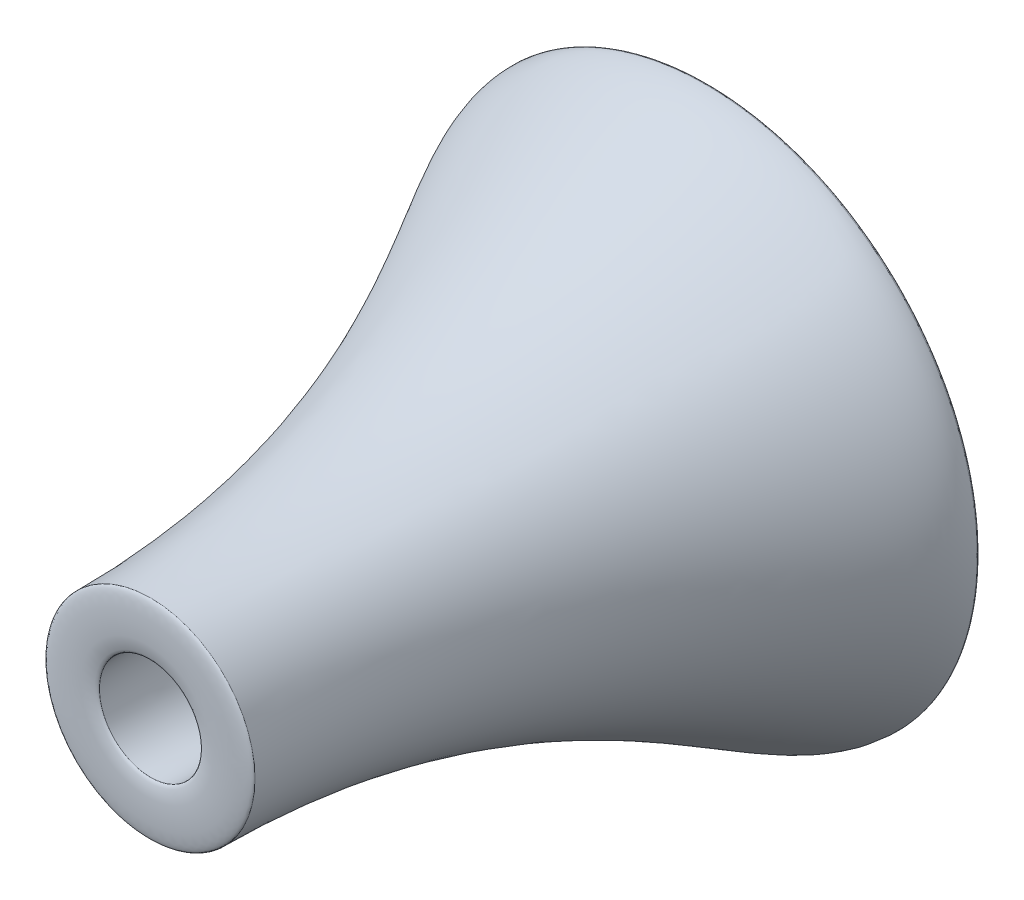
ISO-10303-21;
HEADER;
FILE_DESCRIPTION(('STEP AP214'),'2;1');
FILE_NAME('part.step','',(''),(''),'','','');
FILE_SCHEMA(('AUTOMOTIVE_DESIGN { 1 0 10303 214 1 1 1 1 }'));
ENDSEC;
DATA;
#1=APPLICATION_CONTEXT('core data for automotive mechanical design processes');
#2=APPLICATION_PROTOCOL_DEFINITION('international standard','automotive_design',2000,#1);
#3=PRODUCT_CONTEXT('',#1,'mechanical');
#4=PRODUCT('Part','Part','',(#3));
#5=PRODUCT_RELATED_PRODUCT_CATEGORY('part','',(#4));
#6=PRODUCT_DEFINITION_FORMATION('','',#4);
#7=PRODUCT_DEFINITION_CONTEXT('part definition',#1,'design');
#8=PRODUCT_DEFINITION('design','',#6,#7);
#9=PRODUCT_DEFINITION_SHAPE('','',#8);
#10=(LENGTH_UNIT() NAMED_UNIT(*) SI_UNIT(.MILLI.,.METRE.));
#11=(NAMED_UNIT(*) PLANE_ANGLE_UNIT() SI_UNIT($,.RADIAN.));
#12=(NAMED_UNIT(*) SI_UNIT($,.STERADIAN.) SOLID_ANGLE_UNIT());
#13=UNCERTAINTY_MEASURE_WITH_UNIT(LENGTH_MEASURE(1.E-05),#10,'distance_accuracy_value','');
#14=(GEOMETRIC_REPRESENTATION_CONTEXT(3) GLOBAL_UNCERTAINTY_ASSIGNED_CONTEXT((#13)) GLOBAL_UNIT_ASSIGNED_CONTEXT((#10,
#11,#12)) REPRESENTATION_CONTEXT('',''));
#15=CARTESIAN_POINT('',(0.,0.,0.));
#16=DIRECTION('',(0.,0.,1.));
#17=DIRECTION('',(1.,0.,0.));
#18=AXIS2_PLACEMENT_3D('',#15,#16,#17);
#19=CARTESIAN_POINT('',(-225.523950171307,0.,1080.69122291502));
#20=CARTESIAN_POINT('',(-225.523950171307,0.,1093.39122291502));
#21=CARTESIAN_POINT('',(-110.643738413778,0.,1093.39122291502));
#22=CARTESIAN_POINT('',(-110.643738413778,0.,1080.69122291502));
#23=B_SPLINE_CURVE_WITH_KNOTS('',3,(#19,#20,#21,#22),.UNSPECIFIED.,.F.,.F.,(4,4),(0.,1.),.UNSPECIFIED.);
#24=CARTESIAN_POINT('',(0.,0.,1104.75683012291));
#25=DIRECTION('',(0.,0.,1.));
#26=AXIS1_PLACEMENT('',#24,#25);
#27=SURFACE_OF_REVOLUTION('',#23,#26);
#28=CARTESIAN_POINT('',(0.,0.,1080.69122291502));
#29=DIRECTION('',(0.,0.,1.));
#30=DIRECTION('',(1.,0.,0.));
#31=AXIS2_PLACEMENT_3D('',#28,#29,#30);
#32=CIRCLE('',#31,110.643738413778);
#33=CARTESIAN_POINT('',(110.643738413778,0.,1080.69122291502));
#34=VERTEX_POINT('',#33);
#35=EDGE_CURVE('E47',#34,#34,#32,.T.);
#36=ORIENTED_EDGE('',*,*,#35,.F.);
#37=EDGE_LOOP('',(#36));
#38=FACE_BOUND('',#37,.T.);
#39=CARTESIAN_POINT('',(0.,0.,1080.69122291502));
#40=DIRECTION('',(0.,0.,1.));
#41=DIRECTION('',(1.,0.,0.));
#42=AXIS2_PLACEMENT_3D('',#39,#40,#41);
#43=CIRCLE('',#42,225.523950171307);
#44=CARTESIAN_POINT('',(225.523950171307,0.,1080.69122291502));
#45=VERTEX_POINT('',#44);
#46=EDGE_CURVE('E11',#45,#45,#43,.T.);
#47=ORIENTED_EDGE('',*,*,#46,.T.);
#48=EDGE_LOOP('',(#47));
#49=FACE_BOUND('',#48,.T.);
#50=ADVANCED_FACE('F40',(#38,#49),#27,.T.);
#51=CARTESIAN_POINT('',(-225.523950171307,0.,1080.69122291502));
#52=DIRECTION('',(0.,0.,1.));
#53=DIRECTION('',(1.,0.,0.));
#54=AXIS2_PLACEMENT_3D('',#51,#52,#53);
#55=PLANE('',#54);
#56=ORIENTED_EDGE('',*,*,#46,.F.);
#57=EDGE_LOOP('',(#56));
#58=FACE_BOUND('',#57,.T.);
#59=ORIENTED_EDGE('',*,*,#35,.T.);
#60=EDGE_LOOP('',(#59));
#61=FACE_BOUND('',#60,.T.);
#62=ADVANCED_FACE('F59',(#58,#61),#55,.F.);
#63=CLOSED_SHELL('',(#50,#62));
#64=MANIFOLD_SOLID_BREP('B2',#63);
#65=CARTESIAN_POINT('',(-485.686690472605,0.,-117.915687758814));
#66=CARTESIAN_POINT('',(-485.686690472605,0.,-134.849021092148));
#67=CARTESIAN_POINT('',(-587.893481305257,0.,-134.849021092148));
#68=CARTESIAN_POINT('',(-587.893481305257,0.,-117.915687758814));
#69=B_SPLINE_CURVE_WITH_KNOTS('',3,(#65,#66,#67,#68),.UNSPECIFIED.,.F.,.F.,(4,4),(0.,1.),.UNSPECIFIED.);
#70=CARTESIAN_POINT('',(0.,0.,99.6847843209707));
#71=DIRECTION('',(0.,0.,1.));
#72=AXIS1_PLACEMENT('',#70,#71);
#73=SURFACE_OF_REVOLUTION('',#69,#72);
#74=CARTESIAN_POINT('',(0.,0.,-117.915687758814));
#75=DIRECTION('',(0.,0.,1.));
#76=DIRECTION('',(1.,0.,0.));
#77=AXIS2_PLACEMENT_3D('',#74,#75,#76);
#78=CIRCLE('',#77,587.893481305257);
#79=CARTESIAN_POINT('',(587.893481305257,0.,-117.915687758814));
#80=VERTEX_POINT('',#79);
#81=EDGE_CURVE('E39',#80,#80,#78,.T.);
#82=ORIENTED_EDGE('',*,*,#81,.F.);
#83=EDGE_LOOP('',(#82));
#84=FACE_BOUND('',#83,.T.);
#85=CARTESIAN_POINT('',(0.,0.,-117.915687758814));
#86=DIRECTION('',(0.,0.,1.));
#87=DIRECTION('',(1.,0.,0.));
#88=AXIS2_PLACEMENT_3D('',#85,#86,#87);
#89=CIRCLE('',#88,485.686690472604);
#90=CARTESIAN_POINT('',(485.686690472604,0.,-117.915687758814));
#91=VERTEX_POINT('',#90);
#92=EDGE_CURVE('E93',#91,#91,#89,.T.);
#93=ORIENTED_EDGE('',*,*,#92,.T.);
#94=EDGE_LOOP('',(#93));
#95=FACE_BOUND('',#94,.T.);
#96=ADVANCED_FACE('F86',(#84,#95),#73,.T.);
#97=CARTESIAN_POINT('',(-587.893481305257,0.,-117.915687758814));
#98=DIRECTION('',(0.,0.,-1.));
#99=DIRECTION('',(-1.,0.,0.));
#100=AXIS2_PLACEMENT_3D('',#97,#98,#99);
#101=PLANE('',#100);
#102=ORIENTED_EDGE('',*,*,#92,.F.);
#103=EDGE_LOOP('',(#102));
#104=FACE_BOUND('',#103,.T.);
#105=ORIENTED_EDGE('',*,*,#81,.T.);
#106=EDGE_LOOP('',(#105));
#107=FACE_BOUND('',#106,.T.);
#108=ADVANCED_FACE('F106',(#104,#107),#101,.F.);
#109=CLOSED_SHELL('',(#96,#108));
#110=MANIFOLD_SOLID_BREP('B6',#109);
#111=CARTESIAN_POINT('',(-110.643738413778,0.,1080.69122291502));
#112=CARTESIAN_POINT('',(-110.643738413782,0.,791.582602275146));
#113=CARTESIAN_POINT('',(-153.207908822051,0.,723.874268624764));
#114=CARTESIAN_POINT('',(-348.563558655502,0.,337.828003558423));
#115=CARTESIAN_POINT('',(-363.741093583998,0.,68.8838120086154));
#116=CARTESIAN_POINT('',(-485.686690472604,0.,-65.2799352368008));
#117=CARTESIAN_POINT('',(-485.686690472604,0.,-117.915687758814));
#118=B_SPLINE_CURVE_WITH_KNOTS('',3,(#111,#112,#113,#114,#115,#116,#117),.UNSPECIFIED.,.F.,.F.,
(4,1,1,1,4),(0.,0.515022649097204,0.793493092504956,0.841990827595236,1.),.UNSPECIFIED.);
#119=CARTESIAN_POINT('',(0.,0.,99.6847843209707));
#120=DIRECTION('',(0.,0.,1.));
#121=AXIS1_PLACEMENT('',#119,#120);
#122=SURFACE_OF_REVOLUTION('',#118,#121);
#123=CARTESIAN_POINT('',(0.,0.,-117.915687758814));
#124=DIRECTION('',(0.,0.,1.));
#125=DIRECTION('',(1.,0.,0.));
#126=AXIS2_PLACEMENT_3D('',#123,#124,#125);
#127=CIRCLE('',#126,485.686690472604);
#128=CARTESIAN_POINT('',(485.686690472604,0.,-117.915687758814));
#129=VERTEX_POINT('',#128);
#130=EDGE_CURVE('E140',#129,#129,#127,.T.);
#131=ORIENTED_EDGE('',*,*,#130,.F.);
#132=EDGE_LOOP('',(#131));
#133=FACE_BOUND('',#132,.T.);
#134=CARTESIAN_POINT('',(0.,0.,1080.69122291502));
#135=DIRECTION('',(0.,0.,1.));
#136=DIRECTION('',(1.,0.,0.));
#137=AXIS2_PLACEMENT_3D('',#134,#135,#136);
#138=CIRCLE('',#137,110.643738413778);
#139=CARTESIAN_POINT('',(110.643738413778,0.,1080.69122291502));
#140=VERTEX_POINT('',#139);
#141=EDGE_CURVE('E85',#140,#140,#138,.T.);
#142=ORIENTED_EDGE('',*,*,#141,.T.);
#143=EDGE_LOOP('',(#142));
#144=FACE_BOUND('',#143,.T.);
#145=ADVANCED_FACE('F125',(#133,#144),#122,.T.);
#146=CARTESIAN_POINT('',(-110.643738413778,0.,1080.69122291502));
#147=DIRECTION('',(0.,0.,-1.));
#148=DIRECTION('',(-1.,0.,0.));
#149=AXIS2_PLACEMENT_3D('',#146,#147,#148);
#150=PLANE('',#149);
#151=ORIENTED_EDGE('',*,*,#141,.F.);
#152=EDGE_LOOP('',(#151));
#153=FACE_BOUND('',#152,.T.);
#154=CARTESIAN_POINT('',(0.,0.,1080.69122291502));
#155=DIRECTION('',(0.,0.,1.));
#156=DIRECTION('',(1.,0.,0.));
#157=AXIS2_PLACEMENT_3D('',#154,#155,#156);
#158=CIRCLE('',#157,225.523950171307);
#159=CARTESIAN_POINT('',(225.523950171307,0.,1080.69122291502));
#160=VERTEX_POINT('',#159);
#161=EDGE_CURVE('E132',#160,#160,#158,.T.);
#162=ORIENTED_EDGE('',*,*,#161,.T.);
#163=EDGE_LOOP('',(#162));
#164=FACE_BOUND('',#163,.T.);
#165=ADVANCED_FACE('F159',(#153,#164),#150,.F.);
#166=CARTESIAN_POINT('',(-587.893481305257,0.,-117.915687758814));
#167=CARTESIAN_POINT('',(-587.893481305257,0.,7.46826461747803));
#168=CARTESIAN_POINT('',(-225.523950171307,0.,350.382102529792));
#169=CARTESIAN_POINT('',(-225.523950171307,0.,1080.69122291502));
#170=B_SPLINE_CURVE_WITH_KNOTS('',3,(#166,#167,#168,#169),.UNSPECIFIED.,.F.,.F.,(4,4),(0.,1.),.UNSPECIFIED.);
#171=CARTESIAN_POINT('',(0.,0.,99.6847843209707));
#172=DIRECTION('',(0.,0.,1.));
#173=AXIS1_PLACEMENT('',#171,#172);
#174=SURFACE_OF_REVOLUTION('',#170,#173);
#175=ORIENTED_EDGE('',*,*,#161,.F.);
#176=EDGE_LOOP('',(#175));
#177=FACE_BOUND('',#176,.T.);
#178=CARTESIAN_POINT('',(0.,0.,-117.915687758814));
#179=DIRECTION('',(0.,0.,1.));
#180=DIRECTION('',(1.,0.,0.));
#181=AXIS2_PLACEMENT_3D('',#178,#179,#180);
#182=CIRCLE('',#181,587.893481305257);
#183=CARTESIAN_POINT('',(587.893481305257,0.,-117.915687758814));
#184=VERTEX_POINT('',#183);
#185=EDGE_CURVE('E136',#184,#184,#182,.T.);
#186=ORIENTED_EDGE('',*,*,#185,.T.);
#187=EDGE_LOOP('',(#186));
#188=FACE_BOUND('',#187,.T.);
#189=ADVANCED_FACE('F155',(#177,#188),#174,.T.);
#190=CARTESIAN_POINT('',(-485.686690472604,0.,-117.915687758814));
#191=DIRECTION('',(0.,0.,1.));
#192=DIRECTION('',(1.,0.,0.));
#193=AXIS2_PLACEMENT_3D('',#190,#191,#192);
#194=PLANE('',#193);
#195=ORIENTED_EDGE('',*,*,#185,.F.);
#196=EDGE_LOOP('',(#195));
#197=FACE_BOUND('',#196,.T.);
#198=ORIENTED_EDGE('',*,*,#130,.T.);
#199=EDGE_LOOP('',(#198));
#200=FACE_BOUND('',#199,.T.);
#201=ADVANCED_FACE('F158',(#197,#200),#194,.F.);
#202=CLOSED_SHELL('',(#145,#165,#189,#201));
#203=MANIFOLD_SOLID_BREP('B34',#202);
#204=ADVANCED_BREP_SHAPE_REPRESENTATION('',(#18,#64,#110,#203),#14);
#205=SHAPE_DEFINITION_REPRESENTATION(#9,#204);
ENDSEC;
END-ISO-10303-21;
